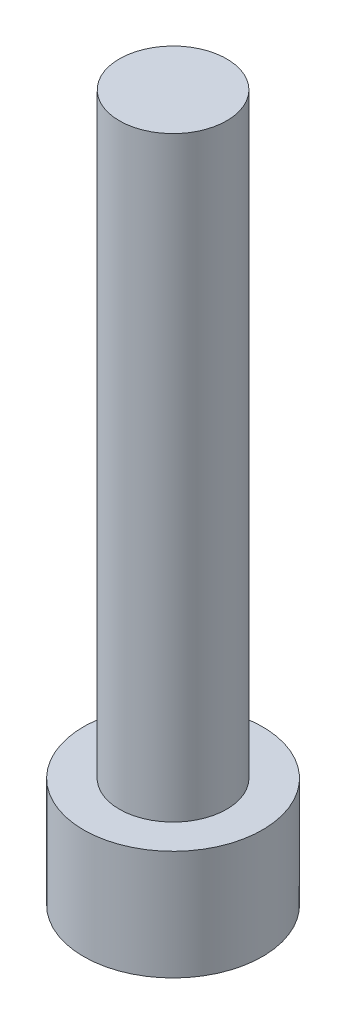
ISO-10303-21;
HEADER;
FILE_DESCRIPTION(('STEP AP214'),'2;1');
FILE_NAME('part.step','',(''),(''),'','','');
FILE_SCHEMA(('AUTOMOTIVE_DESIGN { 1 0 10303 214 1 1 1 1 }'));
ENDSEC;
DATA;
#1=APPLICATION_CONTEXT('core data for automotive mechanical design processes');
#2=APPLICATION_PROTOCOL_DEFINITION('international standard','automotive_design',2000,#1);
#3=PRODUCT_CONTEXT('',#1,'mechanical');
#4=PRODUCT('Part','Part','',(#3));
#5=PRODUCT_RELATED_PRODUCT_CATEGORY('part','',(#4));
#6=PRODUCT_DEFINITION_FORMATION('','',#4);
#7=PRODUCT_DEFINITION_CONTEXT('part definition',#1,'design');
#8=PRODUCT_DEFINITION('design','',#6,#7);
#9=PRODUCT_DEFINITION_SHAPE('','',#8);
#10=(LENGTH_UNIT() NAMED_UNIT(*) SI_UNIT(.MILLI.,.METRE.));
#11=(NAMED_UNIT(*) PLANE_ANGLE_UNIT() SI_UNIT($,.RADIAN.));
#12=(NAMED_UNIT(*) SI_UNIT($,.STERADIAN.) SOLID_ANGLE_UNIT());
#13=UNCERTAINTY_MEASURE_WITH_UNIT(LENGTH_MEASURE(1.E-05),#10,'distance_accuracy_value','');
#14=(GEOMETRIC_REPRESENTATION_CONTEXT(3) GLOBAL_UNCERTAINTY_ASSIGNED_CONTEXT((#13)) GLOBAL_UNIT_ASSIGNED_CONTEXT((#10,
#11,#12)) REPRESENTATION_CONTEXT('',''));
#15=CARTESIAN_POINT('',(0.,0.,0.));
#16=DIRECTION('',(0.,0.,1.));
#17=DIRECTION('',(1.,0.,0.));
#18=AXIS2_PLACEMENT_3D('',#15,#16,#17);
#19=CARTESIAN_POINT('',(0.,3.5052,0.));
#20=DIRECTION('',(0.,1.,0.));
#21=DIRECTION('',(0.,0.,1.));
#22=AXIS2_PLACEMENT_3D('',#19,#20,#21);
#23=PLANE('',#22);
#24=CARTESIAN_POINT('',(0.,3.5052,0.));
#25=DIRECTION('',(0.,1.,0.));
#26=DIRECTION('',(0.,0.,1.));
#27=AXIS2_PLACEMENT_3D('',#24,#25,#26);
#28=CIRCLE('',#27,2.8575);
#29=CARTESIAN_POINT('',(0.,3.5052,2.8575));
#30=VERTEX_POINT('',#29);
#31=EDGE_CURVE('E11',#30,#30,#28,.T.);
#32=ORIENTED_EDGE('',*,*,#31,.T.);
#33=EDGE_LOOP('',(#32));
#34=FACE_BOUND('',#33,.T.);
#35=CARTESIAN_POINT('',(0.,3.5052,0.));
#36=DIRECTION('',(0.,1.,0.));
#37=DIRECTION('',(0.,0.,1.));
#38=AXIS2_PLACEMENT_3D('',#35,#36,#37);
#39=CIRCLE('',#38,1.7145);
#40=CARTESIAN_POINT('',(0.,3.5052,1.7145));
#41=VERTEX_POINT('',#40);
#42=EDGE_CURVE('E152',#41,#41,#39,.T.);
#43=ORIENTED_EDGE('',*,*,#42,.F.);
#44=EDGE_LOOP('',(#43));
#45=FACE_BOUND('',#44,.T.);
#46=ADVANCED_FACE('F33',(#34,#45),#23,.T.);
#47=CARTESIAN_POINT('',(0.,3.5052,0.));
#48=DIRECTION('',(0.,-1.,0.));
#49=DIRECTION('',(0.,0.,-1.));
#50=AXIS2_PLACEMENT_3D('',#47,#48,#49);
#51=CYLINDRICAL_SURFACE('',#50,2.8575);
#52=ORIENTED_EDGE('',*,*,#31,.F.);
#53=EDGE_LOOP('',(#52));
#54=FACE_BOUND('',#53,.T.);
#55=CARTESIAN_POINT('',(0.,0.,0.));
#56=DIRECTION('',(0.,1.,0.));
#57=DIRECTION('',(0.,0.,1.));
#58=AXIS2_PLACEMENT_3D('',#55,#56,#57);
#59=CIRCLE('',#58,2.8575);
#60=CARTESIAN_POINT('',(0.,0.,2.8575));
#61=VERTEX_POINT('',#60);
#62=EDGE_CURVE('E37',#61,#61,#59,.T.);
#63=ORIENTED_EDGE('',*,*,#62,.T.);
#64=EDGE_LOOP('',(#63));
#65=FACE_BOUND('',#64,.T.);
#66=ADVANCED_FACE('F35',(#54,#65),#51,.T.);
#67=CARTESIAN_POINT('',(0.,0.,0.));
#68=DIRECTION('',(0.,1.,0.));
#69=DIRECTION('',(0.,0.,1.));
#70=AXIS2_PLACEMENT_3D('',#67,#68,#69);
#71=PLANE('',#70);
#72=DIRECTION('',(-0.500000000000001,0.,0.866025403784438));
#73=VECTOR('',#72,1.);
#74=CARTESIAN_POINT('',(1.60395121659243,0.,0.));
#75=LINE('',#74,#73);
#76=CARTESIAN_POINT('',(1.60395121659243,0.,0.));
#77=VERTEX_POINT('',#76);
#78=CARTESIAN_POINT('',(0.801975608296214,0.,1.3890625));
#79=VERTEX_POINT('',#78);
#80=EDGE_CURVE('E122',#77,#79,#75,.T.);
#81=ORIENTED_EDGE('',*,*,#80,.F.);
#82=DIRECTION('',(0.5,0.,0.866025403784439));
#83=VECTOR('',#82,1.);
#84=CARTESIAN_POINT('',(0.801975608296215,0.,-1.3890625));
#85=LINE('',#84,#83);
#86=CARTESIAN_POINT('',(0.801975608296215,0.,-1.3890625));
#87=VERTEX_POINT('',#86);
#88=EDGE_CURVE('E48',#87,#77,#85,.T.);
#89=ORIENTED_EDGE('',*,*,#88,.F.);
#90=DIRECTION('',(1.,0.,0.));
#91=VECTOR('',#90,1.);
#92=CARTESIAN_POINT('',(-0.801975608296214,0.,-1.3890625));
#93=LINE('',#92,#91);
#94=CARTESIAN_POINT('',(-0.801975608296214,0.,-1.3890625));
#95=VERTEX_POINT('',#94);
#96=EDGE_CURVE('E132',#95,#87,#93,.T.);
#97=ORIENTED_EDGE('',*,*,#96,.F.);
#98=DIRECTION('',(0.5,0.,-0.866025403784438));
#99=VECTOR('',#98,1.);
#100=CARTESIAN_POINT('',(-1.60395121659243,0.,0.));
#101=LINE('',#100,#99);
#102=CARTESIAN_POINT('',(-1.60395121659243,0.,0.));
#103=VERTEX_POINT('',#102);
#104=EDGE_CURVE('E130',#103,#95,#101,.T.);
#105=ORIENTED_EDGE('',*,*,#104,.F.);
#106=DIRECTION('',(-0.5,0.,-0.866025403784439));
#107=VECTOR('',#106,1.);
#108=CARTESIAN_POINT('',(-0.801975608296214,0.,1.3890625));
#109=LINE('',#108,#107);
#110=CARTESIAN_POINT('',(-0.801975608296214,0.,1.3890625));
#111=VERTEX_POINT('',#110);
#112=EDGE_CURVE('E96',#111,#103,#109,.T.);
#113=ORIENTED_EDGE('',*,*,#112,.F.);
#114=DIRECTION('',(-1.,0.,0.));
#115=VECTOR('',#114,1.);
#116=CARTESIAN_POINT('',(0.801975608296214,0.,1.3890625));
#117=LINE('',#116,#115);
#118=EDGE_CURVE('E126',#79,#111,#117,.T.);
#119=ORIENTED_EDGE('',*,*,#118,.F.);
#120=EDGE_LOOP('',(#81,#89,#97,#105,#113,#119));
#121=FACE_BOUND('',#120,.T.);
#122=ORIENTED_EDGE('',*,*,#62,.F.);
#123=EDGE_LOOP('',(#122));
#124=FACE_BOUND('',#123,.T.);
#125=ADVANCED_FACE('F145',(#121,#124),#71,.F.);
#126=CARTESIAN_POINT('',(0.801975608296215,1.9558,-1.3890625));
#127=DIRECTION('',(0.866025403784438,0.,-0.5));
#128=DIRECTION('',(-0.5,0.,-0.866025403784439));
#129=AXIS2_PLACEMENT_3D('',#126,#127,#128);
#130=PLANE('',#129);
#131=ORIENTED_EDGE('',*,*,#88,.T.);
#132=DIRECTION('',(0.,-1.,0.));
#133=VECTOR('',#132,1.);
#134=CARTESIAN_POINT('',(1.60395121659243,1.9558,0.));
#135=LINE('',#134,#133);
#136=CARTESIAN_POINT('',(1.60395121659243,1.9558,0.));
#137=VERTEX_POINT('',#136);
#138=EDGE_CURVE('E78',#137,#77,#135,.T.);
#139=ORIENTED_EDGE('',*,*,#138,.F.);
#140=DIRECTION('',(0.5,0.,0.866025403784439));
#141=VECTOR('',#140,1.);
#142=CARTESIAN_POINT('',(0.801975608296215,1.9558,-1.3890625));
#143=LINE('',#142,#141);
#144=CARTESIAN_POINT('',(0.801975608296215,1.9558,-1.3890625));
#145=VERTEX_POINT('',#144);
#146=EDGE_CURVE('E134',#145,#137,#143,.T.);
#147=ORIENTED_EDGE('',*,*,#146,.F.);
#148=DIRECTION('',(0.,-1.,0.));
#149=VECTOR('',#148,1.);
#150=CARTESIAN_POINT('',(0.801975608296215,1.9558,-1.3890625));
#151=LINE('',#150,#149);
#152=EDGE_CURVE('E56',#145,#87,#151,.T.);
#153=ORIENTED_EDGE('',*,*,#152,.T.);
#154=EDGE_LOOP('',(#131,#139,#147,#153));
#155=FACE_BOUND('',#154,.T.);
#156=ADVANCED_FACE('F174',(#155),#130,.F.);
#157=CARTESIAN_POINT('',(-0.801975608296214,1.9558,-1.3890625));
#158=DIRECTION('',(0.,0.,-1.));
#159=DIRECTION('',(-1.,0.,0.));
#160=AXIS2_PLACEMENT_3D('',#157,#158,#159);
#161=PLANE('',#160);
#162=ORIENTED_EDGE('',*,*,#96,.T.);
#163=ORIENTED_EDGE('',*,*,#152,.F.);
#164=DIRECTION('',(1.,0.,0.));
#165=VECTOR('',#164,1.);
#166=CARTESIAN_POINT('',(-0.801975608296214,1.9558,-1.3890625));
#167=LINE('',#166,#165);
#168=CARTESIAN_POINT('',(-0.801975608296214,1.9558,-1.3890625));
#169=VERTEX_POINT('',#168);
#170=EDGE_CURVE('E108',#169,#145,#167,.T.);
#171=ORIENTED_EDGE('',*,*,#170,.F.);
#172=DIRECTION('',(0.,-1.,0.));
#173=VECTOR('',#172,1.);
#174=CARTESIAN_POINT('',(-0.801975608296214,1.9558,-1.3890625));
#175=LINE('',#174,#173);
#176=EDGE_CURVE('E100',#169,#95,#175,.T.);
#177=ORIENTED_EDGE('',*,*,#176,.T.);
#178=EDGE_LOOP('',(#162,#163,#171,#177));
#179=FACE_BOUND('',#178,.T.);
#180=ADVANCED_FACE('F180',(#179),#161,.F.);
#181=CARTESIAN_POINT('',(-1.60395121659243,1.9558,0.));
#182=DIRECTION('',(-0.866025403784438,0.,-0.5));
#183=DIRECTION('',(-0.5,0.,0.866025403784439));
#184=AXIS2_PLACEMENT_3D('',#181,#182,#183);
#185=PLANE('',#184);
#186=ORIENTED_EDGE('',*,*,#104,.T.);
#187=ORIENTED_EDGE('',*,*,#176,.F.);
#188=DIRECTION('',(0.5,0.,-0.866025403784438));
#189=VECTOR('',#188,1.);
#190=CARTESIAN_POINT('',(-1.60395121659243,1.9558,0.));
#191=LINE('',#190,#189);
#192=CARTESIAN_POINT('',(-1.60395121659243,1.9558,0.));
#193=VERTEX_POINT('',#192);
#194=EDGE_CURVE('E104',#193,#169,#191,.T.);
#195=ORIENTED_EDGE('',*,*,#194,.F.);
#196=DIRECTION('',(0.,-1.,0.));
#197=VECTOR('',#196,1.);
#198=CARTESIAN_POINT('',(-1.60395121659243,1.9558,0.));
#199=LINE('',#198,#197);
#200=EDGE_CURVE('E89',#193,#103,#199,.T.);
#201=ORIENTED_EDGE('',*,*,#200,.T.);
#202=EDGE_LOOP('',(#186,#187,#195,#201));
#203=FACE_BOUND('',#202,.T.);
#204=ADVANCED_FACE('F105',(#203),#185,.F.);
#205=CARTESIAN_POINT('',(-0.801975608296214,1.9558,1.3890625));
#206=DIRECTION('',(-0.866025403784439,0.,0.5));
#207=DIRECTION('',(0.5,0.,0.866025403784439));
#208=AXIS2_PLACEMENT_3D('',#205,#206,#207);
#209=PLANE('',#208);
#210=ORIENTED_EDGE('',*,*,#112,.T.);
#211=ORIENTED_EDGE('',*,*,#200,.F.);
#212=DIRECTION('',(-0.5,0.,-0.866025403784439));
#213=VECTOR('',#212,1.);
#214=CARTESIAN_POINT('',(-0.801975608296214,1.9558,1.3890625));
#215=LINE('',#214,#213);
#216=CARTESIAN_POINT('',(-0.801975608296214,1.9558,1.3890625));
#217=VERTEX_POINT('',#216);
#218=EDGE_CURVE('E93',#217,#193,#215,.T.);
#219=ORIENTED_EDGE('',*,*,#218,.F.);
#220=DIRECTION('',(0.,-1.,0.));
#221=VECTOR('',#220,1.);
#222=CARTESIAN_POINT('',(-0.801975608296214,1.9558,1.3890625));
#223=LINE('',#222,#221);
#224=EDGE_CURVE('E101',#217,#111,#223,.T.);
#225=ORIENTED_EDGE('',*,*,#224,.T.);
#226=EDGE_LOOP('',(#210,#211,#219,#225));
#227=FACE_BOUND('',#226,.T.);
#228=ADVANCED_FACE('F91',(#227),#209,.F.);
#229=CARTESIAN_POINT('',(0.801975608296214,1.9558,1.3890625));
#230=DIRECTION('',(0.,0.,1.));
#231=DIRECTION('',(1.,0.,0.));
#232=AXIS2_PLACEMENT_3D('',#229,#230,#231);
#233=PLANE('',#232);
#234=ORIENTED_EDGE('',*,*,#118,.T.);
#235=ORIENTED_EDGE('',*,*,#224,.F.);
#236=DIRECTION('',(-1.,0.,0.));
#237=VECTOR('',#236,1.);
#238=CARTESIAN_POINT('',(0.801975608296214,1.9558,1.3890625));
#239=LINE('',#238,#237);
#240=CARTESIAN_POINT('',(0.801975608296214,1.9558,1.3890625));
#241=VERTEX_POINT('',#240);
#242=EDGE_CURVE('E114',#241,#217,#239,.T.);
#243=ORIENTED_EDGE('',*,*,#242,.F.);
#244=DIRECTION('',(0.,-1.,0.));
#245=VECTOR('',#244,1.);
#246=CARTESIAN_POINT('',(0.801975608296214,1.9558,1.3890625));
#247=LINE('',#246,#245);
#248=EDGE_CURVE('E138',#241,#79,#247,.T.);
#249=ORIENTED_EDGE('',*,*,#248,.T.);
#250=EDGE_LOOP('',(#234,#235,#243,#249));
#251=FACE_BOUND('',#250,.T.);
#252=ADVANCED_FACE('F149',(#251),#233,.F.);
#253=CARTESIAN_POINT('',(1.60395121659243,1.9558,0.));
#254=DIRECTION('',(0.866025403784438,0.,0.500000000000001));
#255=DIRECTION('',(0.500000000000001,0.,-0.866025403784438));
#256=AXIS2_PLACEMENT_3D('',#253,#254,#255);
#257=PLANE('',#256);
#258=ORIENTED_EDGE('',*,*,#80,.T.);
#259=ORIENTED_EDGE('',*,*,#248,.F.);
#260=DIRECTION('',(-0.500000000000001,0.,0.866025403784438));
#261=VECTOR('',#260,1.);
#262=CARTESIAN_POINT('',(1.60395121659243,1.9558,0.));
#263=LINE('',#262,#261);
#264=EDGE_CURVE('E116',#137,#241,#263,.T.);
#265=ORIENTED_EDGE('',*,*,#264,.F.);
#266=ORIENTED_EDGE('',*,*,#138,.T.);
#267=EDGE_LOOP('',(#258,#259,#265,#266));
#268=FACE_BOUND('',#267,.T.);
#269=ADVANCED_FACE('F142',(#268),#257,.F.);
#270=CARTESIAN_POINT('',(0.,1.9558,0.));
#271=DIRECTION('',(0.,-1.,0.));
#272=DIRECTION('',(0.,0.,-1.));
#273=AXIS2_PLACEMENT_3D('',#270,#271,#272);
#274=PLANE('',#273);
#275=ORIENTED_EDGE('',*,*,#146,.T.);
#276=ORIENTED_EDGE('',*,*,#264,.T.);
#277=ORIENTED_EDGE('',*,*,#242,.T.);
#278=ORIENTED_EDGE('',*,*,#218,.T.);
#279=ORIENTED_EDGE('',*,*,#194,.T.);
#280=ORIENTED_EDGE('',*,*,#170,.T.);
#281=EDGE_LOOP('',(#275,#276,#277,#278,#279,#280));
#282=FACE_BOUND('',#281,.T.);
#283=ADVANCED_FACE('F111',(#282),#274,.T.);
#284=CARTESIAN_POINT('',(0.,22.5552,0.));
#285=DIRECTION('',(0.,-1.,0.));
#286=DIRECTION('',(0.,0.,-1.));
#287=AXIS2_PLACEMENT_3D('',#284,#285,#286);
#288=CYLINDRICAL_SURFACE('',#287,1.7145);
#289=CARTESIAN_POINT('',(0.,22.5552,0.));
#290=DIRECTION('',(0.,1.,0.));
#291=DIRECTION('',(0.,0.,1.));
#292=AXIS2_PLACEMENT_3D('',#289,#290,#291);
#293=CIRCLE('',#292,1.7145);
#294=CARTESIAN_POINT('',(0.,22.5552,1.7145));
#295=VERTEX_POINT('',#294);
#296=EDGE_CURVE('E123',#295,#295,#293,.T.);
#297=ORIENTED_EDGE('',*,*,#296,.F.);
#298=EDGE_LOOP('',(#297));
#299=FACE_BOUND('',#298,.T.);
#300=ORIENTED_EDGE('',*,*,#42,.T.);
#301=EDGE_LOOP('',(#300));
#302=FACE_BOUND('',#301,.T.);
#303=ADVANCED_FACE('F160',(#299,#302),#288,.T.);
#304=CARTESIAN_POINT('',(0.,22.5552,0.));
#305=DIRECTION('',(0.,1.,0.));
#306=DIRECTION('',(0.,0.,1.));
#307=AXIS2_PLACEMENT_3D('',#304,#305,#306);
#308=PLANE('',#307);
#309=ORIENTED_EDGE('',*,*,#296,.T.);
#310=EDGE_LOOP('',(#309));
#311=FACE_BOUND('',#310,.T.);
#312=ADVANCED_FACE('F158',(#311),#308,.T.);
#313=CLOSED_SHELL('',(#46,#66,#125,#156,#180,#204,#228,#252,#269,#283,#303,#312));
#314=MANIFOLD_SOLID_BREP('B2',#313);
#315=ADVANCED_BREP_SHAPE_REPRESENTATION('',(#18,#314),#14);
#316=SHAPE_DEFINITION_REPRESENTATION(#9,#315);
ENDSEC;
END-ISO-10303-21;
